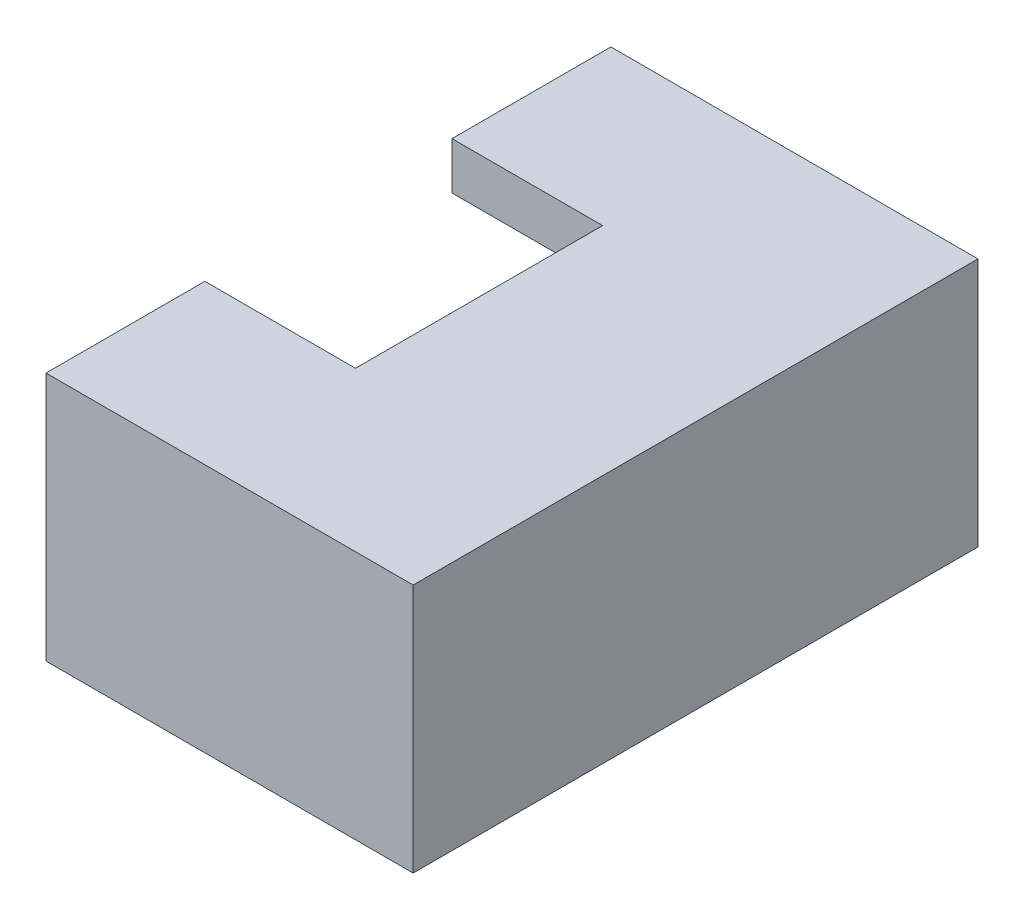
ISO-10303-21;
HEADER;
FILE_DESCRIPTION(('STEP AP214'),'2;1');
FILE_NAME('part.step','',(''),(''),'','','');
FILE_SCHEMA(('AUTOMOTIVE_DESIGN { 1 0 10303 214 1 1 1 1 }'));
ENDSEC;
DATA;
#1=APPLICATION_CONTEXT('core data for automotive mechanical design processes');
#2=APPLICATION_PROTOCOL_DEFINITION('international standard','automotive_design',2000,#1);
#3=PRODUCT_CONTEXT('',#1,'mechanical');
#4=PRODUCT('Part','Part','',(#3));
#5=PRODUCT_RELATED_PRODUCT_CATEGORY('part','',(#4));
#6=PRODUCT_DEFINITION_FORMATION('','',#4);
#7=PRODUCT_DEFINITION_CONTEXT('part definition',#1,'design');
#8=PRODUCT_DEFINITION('design','',#6,#7);
#9=PRODUCT_DEFINITION_SHAPE('','',#8);
#10=(LENGTH_UNIT() NAMED_UNIT(*) SI_UNIT(.MILLI.,.METRE.));
#11=(NAMED_UNIT(*) PLANE_ANGLE_UNIT() SI_UNIT($,.RADIAN.));
#12=(NAMED_UNIT(*) SI_UNIT($,.STERADIAN.) SOLID_ANGLE_UNIT());
#13=UNCERTAINTY_MEASURE_WITH_UNIT(LENGTH_MEASURE(1.E-05),#10,'distance_accuracy_value','');
#14=(GEOMETRIC_REPRESENTATION_CONTEXT(3) GLOBAL_UNCERTAINTY_ASSIGNED_CONTEXT((#13)) GLOBAL_UNIT_ASSIGNED_CONTEXT((#10,
#11,#12)) REPRESENTATION_CONTEXT('',''));
#15=CARTESIAN_POINT('',(0.,0.,0.));
#16=DIRECTION('',(0.,0.,1.));
#17=DIRECTION('',(1.,0.,0.));
#18=AXIS2_PLACEMENT_3D('',#15,#16,#17);
#19=CARTESIAN_POINT('',(3.55,3.4,-1.3));
#20=DIRECTION('',(0.,-1.,0.));
#21=DIRECTION('',(0.,0.,-1.));
#22=AXIS2_PLACEMENT_3D('',#19,#20,#21);
#23=PLANE('',#22);
#24=DIRECTION('',(1.,0.,0.));
#25=VECTOR('',#24,1.);
#26=CARTESIAN_POINT('',(3.55,3.4,-1.3));
#27=LINE('',#26,#25);
#28=CARTESIAN_POINT('',(7.55,3.4,-1.3));
#29=VERTEX_POINT('',#28);
#30=CARTESIAN_POINT('',(3.55,3.4,-1.3));
#31=VERTEX_POINT('',#30);
#32=EDGE_CURVE('P0_E64',#29,#31,#27,.F.);
#33=ORIENTED_EDGE('',*,*,#32,.T.);
#34=DIRECTION('',(0.,0.,1.));
#35=VECTOR('',#34,1.);
#36=CARTESIAN_POINT('',(3.55000000000001,3.4,0.));
#37=LINE('',#36,#35);
#38=CARTESIAN_POINT('',(3.55,3.4,-0.999999999999999));
#39=VERTEX_POINT('',#38);
#40=EDGE_CURVE('P0_E54',#39,#31,#37,.F.);
#41=ORIENTED_EDGE('',*,*,#40,.F.);
#42=DIRECTION('',(-1.,0.,0.));
#43=VECTOR('',#42,1.);
#44=CARTESIAN_POINT('',(3.55,3.4,-0.999999999999999));
#45=LINE('',#44,#43);
#46=CARTESIAN_POINT('',(7.55,3.4,-1.));
#47=VERTEX_POINT('',#46);
#48=EDGE_CURVE('P0_E74',#39,#47,#45,.F.);
#49=ORIENTED_EDGE('',*,*,#48,.T.);
#50=DIRECTION('',(0.,0.,-1.));
#51=VECTOR('',#50,1.);
#52=CARTESIAN_POINT('',(7.55,3.4,-1.3));
#53=LINE('',#52,#51);
#54=EDGE_CURVE('P0_E19',#29,#47,#53,.F.);
#55=ORIENTED_EDGE('',*,*,#54,.F.);
#56=EDGE_LOOP('',(#33,#41,#49,#55));
#57=FACE_BOUND('',#56,.T.);
#58=ADVANCED_FACE('P0_F16',(#57),#23,.F.);
#59=CARTESIAN_POINT('',(3.55,3.4,-1.3));
#60=DIRECTION('',(0.,0.,1.));
#61=DIRECTION('',(1.,0.,0.));
#62=AXIS2_PLACEMENT_3D('',#59,#60,#61);
#63=PLANE('',#62);
#64=DIRECTION('',(1.,0.,0.));
#65=VECTOR('',#64,1.);
#66=CARTESIAN_POINT('',(3.55,3.1,-1.3));
#67=LINE('',#66,#65);
#68=CARTESIAN_POINT('',(7.55,3.1,-1.3));
#69=VERTEX_POINT('',#68);
#70=CARTESIAN_POINT('',(3.55,3.1,-1.3));
#71=VERTEX_POINT('',#70);
#72=EDGE_CURVE('P0_E72',#69,#71,#67,.F.);
#73=ORIENTED_EDGE('',*,*,#72,.T.);
#74=DIRECTION('',(0.,1.,0.));
#75=VECTOR('',#74,1.);
#76=CARTESIAN_POINT('',(3.55,0.,-1.3));
#77=LINE('',#76,#75);
#78=EDGE_CURVE('P0_E61',#31,#71,#77,.F.);
#79=ORIENTED_EDGE('',*,*,#78,.F.);
#80=ORIENTED_EDGE('',*,*,#32,.F.);
#81=DIRECTION('',(0.,1.,0.));
#82=VECTOR('',#81,1.);
#83=CARTESIAN_POINT('',(7.55,0.,-1.3));
#84=LINE('',#83,#82);
#85=EDGE_CURVE('P0_E78',#29,#69,#84,.F.);
#86=ORIENTED_EDGE('',*,*,#85,.T.);
#87=EDGE_LOOP('',(#73,#79,#80,#86));
#88=FACE_BOUND('',#87,.T.);
#89=ADVANCED_FACE('P0_F71',(#88),#63,.F.);
#90=CARTESIAN_POINT('',(3.55000000000001,0.,0.));
#91=DIRECTION('',(-1.,0.,0.));
#92=DIRECTION('',(0.,0.,1.));
#93=AXIS2_PLACEMENT_3D('',#90,#91,#92);
#94=PLANE('',#93);
#95=ORIENTED_EDGE('',*,*,#78,.T.);
#96=DIRECTION('',(0.,0.,1.));
#97=VECTOR('',#96,1.);
#98=CARTESIAN_POINT('',(3.55,3.1,-1.3));
#99=LINE('',#98,#97);
#100=CARTESIAN_POINT('',(3.55,3.1,-0.999999999999999));
#101=VERTEX_POINT('',#100);
#102=EDGE_CURVE('P0_E82',#71,#101,#99,.T.);
#103=ORIENTED_EDGE('',*,*,#102,.T.);
#104=DIRECTION('',(0.,1.,0.));
#105=VECTOR('',#104,1.);
#106=CARTESIAN_POINT('',(3.55,3.4,-0.999999999999999));
#107=LINE('',#106,#105);
#108=EDGE_CURVE('P0_E63',#101,#39,#107,.T.);
#109=ORIENTED_EDGE('',*,*,#108,.T.);
#110=ORIENTED_EDGE('',*,*,#40,.T.);
#111=EDGE_LOOP('',(#95,#103,#109,#110));
#112=FACE_BOUND('',#111,.T.);
#113=ADVANCED_FACE('P0_F58',(#112),#94,.T.);
#114=CARTESIAN_POINT('',(3.55,3.4,-0.999999999999999));
#115=DIRECTION('',(0.,0.,-1.));
#116=DIRECTION('',(-1.,0.,0.));
#117=AXIS2_PLACEMENT_3D('',#114,#115,#116);
#118=PLANE('',#117);
#119=ORIENTED_EDGE('',*,*,#48,.F.);
#120=ORIENTED_EDGE('',*,*,#108,.F.);
#121=DIRECTION('',(1.,0.,0.));
#122=VECTOR('',#121,1.);
#123=CARTESIAN_POINT('',(3.55,3.1,-0.999999999999999));
#124=LINE('',#123,#122);
#125=CARTESIAN_POINT('',(7.55,3.1,-1.));
#126=VERTEX_POINT('',#125);
#127=EDGE_CURVE('P0_E25',#101,#126,#124,.T.);
#128=ORIENTED_EDGE('',*,*,#127,.T.);
#129=DIRECTION('',(0.,1.,0.));
#130=VECTOR('',#129,1.);
#131=CARTESIAN_POINT('',(7.55,0.,-1.));
#132=LINE('',#131,#130);
#133=EDGE_CURVE('P0_E33',#126,#47,#132,.T.);
#134=ORIENTED_EDGE('',*,*,#133,.T.);
#135=EDGE_LOOP('',(#119,#120,#128,#134));
#136=FACE_BOUND('',#135,.T.);
#137=ADVANCED_FACE('P0_F87',(#136),#118,.F.);
#138=CARTESIAN_POINT('',(7.55000000000001,0.,0.));
#139=DIRECTION('',(-1.,0.,0.));
#140=DIRECTION('',(0.,0.,1.));
#141=AXIS2_PLACEMENT_3D('',#138,#139,#140);
#142=PLANE('',#141);
#143=DIRECTION('',(0.,0.,1.));
#144=VECTOR('',#143,1.);
#145=CARTESIAN_POINT('',(7.55,3.1,-1.3));
#146=LINE('',#145,#144);
#147=EDGE_CURVE('P0_E11',#126,#69,#146,.F.);
#148=ORIENTED_EDGE('',*,*,#147,.T.);
#149=ORIENTED_EDGE('',*,*,#85,.F.);
#150=ORIENTED_EDGE('',*,*,#54,.T.);
#151=ORIENTED_EDGE('',*,*,#133,.F.);
#152=EDGE_LOOP('',(#148,#149,#150,#151));
#153=FACE_BOUND('',#152,.T.);
#154=ADVANCED_FACE('P0_F90',(#153),#142,.F.);
#155=CARTESIAN_POINT('',(3.55,3.1,-1.3));
#156=DIRECTION('',(0.,1.,0.));
#157=DIRECTION('',(0.,0.,1.));
#158=AXIS2_PLACEMENT_3D('',#155,#156,#157);
#159=PLANE('',#158);
#160=ORIENTED_EDGE('',*,*,#127,.F.);
#161=ORIENTED_EDGE('',*,*,#102,.F.);
#162=ORIENTED_EDGE('',*,*,#72,.F.);
#163=ORIENTED_EDGE('',*,*,#147,.F.);
#164=EDGE_LOOP('',(#160,#161,#162,#163));
#165=FACE_BOUND('',#164,.T.);
#166=ADVANCED_FACE('P0_F89',(#165),#159,.F.);
#167=CLOSED_SHELL('',(#58,#89,#113,#137,#154,#166));
#168=MANIFOLD_SOLID_BREP('P0_B1',#167);
#169=CARTESIAN_POINT('',(3.55,3.4,1.));
#170=DIRECTION('',(0.,-1.,0.));
#171=DIRECTION('',(0.,0.,-1.));
#172=AXIS2_PLACEMENT_3D('',#169,#170,#171);
#173=PLANE('',#172);
#174=DIRECTION('',(1.,0.,0.));
#175=VECTOR('',#174,1.);
#176=CARTESIAN_POINT('',(3.55,3.4,1.));
#177=LINE('',#176,#175);
#178=CARTESIAN_POINT('',(7.55,3.4,1.));
#179=VERTEX_POINT('',#178);
#180=CARTESIAN_POINT('',(3.55,3.4,1.));
#181=VERTEX_POINT('',#180);
#182=EDGE_CURVE('P1_E64',#179,#181,#177,.F.);
#183=ORIENTED_EDGE('',*,*,#182,.T.);
#184=DIRECTION('',(0.,0.,1.));
#185=VECTOR('',#184,1.);
#186=CARTESIAN_POINT('',(3.55,3.4,0.));
#187=LINE('',#186,#185);
#188=CARTESIAN_POINT('',(3.55,3.4,1.3));
#189=VERTEX_POINT('',#188);
#190=EDGE_CURVE('P1_E54',#189,#181,#187,.F.);
#191=ORIENTED_EDGE('',*,*,#190,.F.);
#192=DIRECTION('',(-1.,0.,0.));
#193=VECTOR('',#192,1.);
#194=CARTESIAN_POINT('',(3.55,3.4,1.3));
#195=LINE('',#194,#193);
#196=CARTESIAN_POINT('',(7.55,3.4,1.3));
#197=VERTEX_POINT('',#196);
#198=EDGE_CURVE('P1_E74',#189,#197,#195,.F.);
#199=ORIENTED_EDGE('',*,*,#198,.T.);
#200=DIRECTION('',(0.,0.,-1.));
#201=VECTOR('',#200,1.);
#202=CARTESIAN_POINT('',(7.55,3.4,1.));
#203=LINE('',#202,#201);
#204=EDGE_CURVE('P1_E19',#179,#197,#203,.F.);
#205=ORIENTED_EDGE('',*,*,#204,.F.);
#206=EDGE_LOOP('',(#183,#191,#199,#205));
#207=FACE_BOUND('',#206,.T.);
#208=ADVANCED_FACE('P1_F16',(#207),#173,.F.);
#209=CARTESIAN_POINT('',(3.55,3.4,1.));
#210=DIRECTION('',(0.,0.,1.));
#211=DIRECTION('',(1.,0.,0.));
#212=AXIS2_PLACEMENT_3D('',#209,#210,#211);
#213=PLANE('',#212);
#214=DIRECTION('',(1.,0.,0.));
#215=VECTOR('',#214,1.);
#216=CARTESIAN_POINT('',(3.55,3.1,0.999999999999999));
#217=LINE('',#216,#215);
#218=CARTESIAN_POINT('',(7.55,3.1,0.999999999999999));
#219=VERTEX_POINT('',#218);
#220=CARTESIAN_POINT('',(3.55,3.1,1.));
#221=VERTEX_POINT('',#220);
#222=EDGE_CURVE('P1_E72',#219,#221,#217,.F.);
#223=ORIENTED_EDGE('',*,*,#222,.T.);
#224=DIRECTION('',(0.,1.,0.));
#225=VECTOR('',#224,1.);
#226=CARTESIAN_POINT('',(3.55,0.,1.));
#227=LINE('',#226,#225);
#228=EDGE_CURVE('P1_E61',#181,#221,#227,.F.);
#229=ORIENTED_EDGE('',*,*,#228,.F.);
#230=ORIENTED_EDGE('',*,*,#182,.F.);
#231=DIRECTION('',(0.,1.,0.));
#232=VECTOR('',#231,1.);
#233=CARTESIAN_POINT('',(7.55,0.,0.999999999999999));
#234=LINE('',#233,#232);
#235=EDGE_CURVE('P1_E78',#179,#219,#234,.F.);
#236=ORIENTED_EDGE('',*,*,#235,.T.);
#237=EDGE_LOOP('',(#223,#229,#230,#236));
#238=FACE_BOUND('',#237,.T.);
#239=ADVANCED_FACE('P1_F71',(#238),#213,.F.);
#240=CARTESIAN_POINT('',(3.55,0.,0.));
#241=DIRECTION('',(-1.,0.,0.));
#242=DIRECTION('',(0.,0.,1.));
#243=AXIS2_PLACEMENT_3D('',#240,#241,#242);
#244=PLANE('',#243);
#245=ORIENTED_EDGE('',*,*,#228,.T.);
#246=DIRECTION('',(0.,0.,1.));
#247=VECTOR('',#246,1.);
#248=CARTESIAN_POINT('',(3.55,3.1,1.));
#249=LINE('',#248,#247);
#250=CARTESIAN_POINT('',(3.55,3.1,1.3));
#251=VERTEX_POINT('',#250);
#252=EDGE_CURVE('P1_E82',#221,#251,#249,.T.);
#253=ORIENTED_EDGE('',*,*,#252,.T.);
#254=DIRECTION('',(0.,1.,0.));
#255=VECTOR('',#254,1.);
#256=CARTESIAN_POINT('',(3.55,3.4,1.3));
#257=LINE('',#256,#255);
#258=EDGE_CURVE('P1_E63',#251,#189,#257,.T.);
#259=ORIENTED_EDGE('',*,*,#258,.T.);
#260=ORIENTED_EDGE('',*,*,#190,.T.);
#261=EDGE_LOOP('',(#245,#253,#259,#260));
#262=FACE_BOUND('',#261,.T.);
#263=ADVANCED_FACE('P1_F58',(#262),#244,.T.);
#264=CARTESIAN_POINT('',(3.55,3.4,1.3));
#265=DIRECTION('',(0.,0.,-1.));
#266=DIRECTION('',(-1.,0.,0.));
#267=AXIS2_PLACEMENT_3D('',#264,#265,#266);
#268=PLANE('',#267);
#269=ORIENTED_EDGE('',*,*,#198,.F.);
#270=ORIENTED_EDGE('',*,*,#258,.F.);
#271=DIRECTION('',(1.,0.,0.));
#272=VECTOR('',#271,1.);
#273=CARTESIAN_POINT('',(3.55,3.1,1.3));
#274=LINE('',#273,#272);
#275=CARTESIAN_POINT('',(7.55,3.1,1.3));
#276=VERTEX_POINT('',#275);
#277=EDGE_CURVE('P1_E25',#251,#276,#274,.T.);
#278=ORIENTED_EDGE('',*,*,#277,.T.);
#279=DIRECTION('',(0.,1.,0.));
#280=VECTOR('',#279,1.);
#281=CARTESIAN_POINT('',(7.55,0.,1.3));
#282=LINE('',#281,#280);
#283=EDGE_CURVE('P1_E33',#276,#197,#282,.T.);
#284=ORIENTED_EDGE('',*,*,#283,.T.);
#285=EDGE_LOOP('',(#269,#270,#278,#284));
#286=FACE_BOUND('',#285,.T.);
#287=ADVANCED_FACE('P1_F87',(#286),#268,.F.);
#288=CARTESIAN_POINT('',(7.55,0.,0.));
#289=DIRECTION('',(-1.,0.,0.));
#290=DIRECTION('',(0.,0.,1.));
#291=AXIS2_PLACEMENT_3D('',#288,#289,#290);
#292=PLANE('',#291);
#293=DIRECTION('',(0.,0.,1.));
#294=VECTOR('',#293,1.);
#295=CARTESIAN_POINT('',(7.55,3.1,1.));
#296=LINE('',#295,#294);
#297=EDGE_CURVE('P1_E11',#276,#219,#296,.F.);
#298=ORIENTED_EDGE('',*,*,#297,.T.);
#299=ORIENTED_EDGE('',*,*,#235,.F.);
#300=ORIENTED_EDGE('',*,*,#204,.T.);
#301=ORIENTED_EDGE('',*,*,#283,.F.);
#302=EDGE_LOOP('',(#298,#299,#300,#301));
#303=FACE_BOUND('',#302,.T.);
#304=ADVANCED_FACE('P1_F90',(#303),#292,.F.);
#305=CARTESIAN_POINT('',(3.55,3.1,1.));
#306=DIRECTION('',(0.,1.,0.));
#307=DIRECTION('',(0.,0.,1.));
#308=AXIS2_PLACEMENT_3D('',#305,#306,#307);
#309=PLANE('',#308);
#310=ORIENTED_EDGE('',*,*,#277,.F.);
#311=ORIENTED_EDGE('',*,*,#252,.F.);
#312=ORIENTED_EDGE('',*,*,#222,.F.);
#313=ORIENTED_EDGE('',*,*,#297,.F.);
#314=EDGE_LOOP('',(#310,#311,#312,#313));
#315=FACE_BOUND('',#314,.T.);
#316=ADVANCED_FACE('P1_F89',(#315),#309,.F.);
#317=CLOSED_SHELL('',(#208,#239,#263,#287,#304,#316));
#318=MANIFOLD_SOLID_BREP('P1_B1',#317);
#319=CARTESIAN_POINT('',(7.55,5.55,-5.5));
#320=DIRECTION('',(0.,1.,0.));
#321=DIRECTION('',(0.,0.,1.));
#322=AXIS2_PLACEMENT_3D('',#319,#320,#321);
#323=PLANE('',#322);
#324=DIRECTION('',(-1.,0.,0.));
#325=VECTOR('',#324,1.);
#326=CARTESIAN_POINT('',(7.55,5.55,-5.5));
#327=LINE('',#326,#325);
#328=CARTESIAN_POINT('',(1.45,5.55,-5.5));
#329=VERTEX_POINT('',#328);
#330=CARTESIAN_POINT('',(7.55,5.55,-5.5));
#331=VERTEX_POINT('',#330);
#332=EDGE_CURVE('P2_E175',#329,#331,#327,.F.);
#333=ORIENTED_EDGE('',*,*,#332,.T.);
#334=DIRECTION('',(0.,0.,-1.));
#335=VECTOR('',#334,1.);
#336=CARTESIAN_POINT('',(7.55,5.55,0.));
#337=LINE('',#336,#335);
#338=CARTESIAN_POINT('',(7.55,5.55,-5.));
#339=VERTEX_POINT('',#338);
#340=EDGE_CURVE('P2_E150',#331,#339,#337,.F.);
#341=ORIENTED_EDGE('',*,*,#340,.T.);
#342=DIRECTION('',(1.,0.,0.));
#343=VECTOR('',#342,1.);
#344=CARTESIAN_POINT('',(7.55,5.55,-5.));
#345=LINE('',#344,#343);
#346=CARTESIAN_POINT('',(1.45,5.55,-5.));
#347=VERTEX_POINT('',#346);
#348=EDGE_CURVE('P2_E160',#339,#347,#345,.F.);
#349=ORIENTED_EDGE('',*,*,#348,.T.);
#350=DIRECTION('',(0.,0.,1.));
#351=VECTOR('',#350,1.);
#352=CARTESIAN_POINT('',(1.45,5.55,-5.5));
#353=LINE('',#352,#351);
#354=EDGE_CURVE('P2_E19',#329,#347,#353,.T.);
#355=ORIENTED_EDGE('',*,*,#354,.F.);
#356=EDGE_LOOP('',(#333,#341,#349,#355));
#357=FACE_BOUND('',#356,.T.);
#358=ADVANCED_FACE('P2_F16',(#357),#323,.F.);
#359=CARTESIAN_POINT('',(7.55,5.55,5.5));
#360=DIRECTION('',(0.,1.,0.));
#361=DIRECTION('',(0.,0.,1.));
#362=AXIS2_PLACEMENT_3D('',#359,#360,#361);
#363=PLANE('',#362);
#364=DIRECTION('',(-1.,0.,0.));
#365=VECTOR('',#364,1.);
#366=CARTESIAN_POINT('',(7.55,5.55,5.));
#367=LINE('',#366,#365);
#368=CARTESIAN_POINT('',(1.45,5.55,5.));
#369=VERTEX_POINT('',#368);
#370=CARTESIAN_POINT('',(7.55,5.55,5.));
#371=VERTEX_POINT('',#370);
#372=EDGE_CURVE('P2_E126',#369,#371,#367,.F.);
#373=ORIENTED_EDGE('',*,*,#372,.T.);
#374=DIRECTION('',(0.,0.,-1.));
#375=VECTOR('',#374,1.);
#376=CARTESIAN_POINT('',(7.55,5.55,0.));
#377=LINE('',#376,#375);
#378=CARTESIAN_POINT('',(7.55,5.55,5.5));
#379=VERTEX_POINT('',#378);
#380=EDGE_CURVE('P2_E155',#371,#379,#377,.F.);
#381=ORIENTED_EDGE('',*,*,#380,.T.);
#382=DIRECTION('',(1.,0.,0.));
#383=VECTOR('',#382,1.);
#384=CARTESIAN_POINT('',(7.55,5.55,5.5));
#385=LINE('',#384,#383);
#386=CARTESIAN_POINT('',(1.45,5.55,5.5));
#387=VERTEX_POINT('',#386);
#388=EDGE_CURVE('P2_E132',#379,#387,#385,.F.);
#389=ORIENTED_EDGE('',*,*,#388,.T.);
#390=DIRECTION('',(0.,0.,1.));
#391=VECTOR('',#390,1.);
#392=CARTESIAN_POINT('',(1.45,5.55,5.5));
#393=LINE('',#392,#391);
#394=EDGE_CURVE('P2_E129',#369,#387,#393,.T.);
#395=ORIENTED_EDGE('',*,*,#394,.F.);
#396=EDGE_LOOP('',(#373,#381,#389,#395));
#397=FACE_BOUND('',#396,.T.);
#398=ADVANCED_FACE('P2_F130',(#397),#363,.F.);
#399=CARTESIAN_POINT('',(7.55,5.55,5.));
#400=DIRECTION('',(0.,0.,-1.));
#401=DIRECTION('',(-1.,0.,0.));
#402=AXIS2_PLACEMENT_3D('',#399,#400,#401);
#403=PLANE('',#402);
#404=DIRECTION('',(1.,0.,0.));
#405=VECTOR('',#404,1.);
#406=CARTESIAN_POINT('',(7.55,5.05,5.));
#407=LINE('',#406,#405);
#408=CARTESIAN_POINT('',(1.45,5.05,5.));
#409=VERTEX_POINT('',#408);
#410=CARTESIAN_POINT('',(7.55,5.05,5.));
#411=VERTEX_POINT('',#410);
#412=EDGE_CURVE('P2_E201',#409,#411,#407,.T.);
#413=ORIENTED_EDGE('',*,*,#412,.T.);
#414=DIRECTION('',(0.,1.,0.));
#415=VECTOR('',#414,1.);
#416=CARTESIAN_POINT('',(7.55,0.,5.));
#417=LINE('',#416,#415);
#418=EDGE_CURVE('P2_E143',#411,#371,#417,.T.);
#419=ORIENTED_EDGE('',*,*,#418,.T.);
#420=ORIENTED_EDGE('',*,*,#372,.F.);
#421=DIRECTION('',(0.,1.,0.));
#422=VECTOR('',#421,1.);
#423=CARTESIAN_POINT('',(1.45,5.55,5.));
#424=LINE('',#423,#422);
#425=EDGE_CURVE('P2_E141',#409,#369,#424,.T.);
#426=ORIENTED_EDGE('',*,*,#425,.F.);
#427=EDGE_LOOP('',(#413,#419,#420,#426));
#428=FACE_BOUND('',#427,.T.);
#429=ADVANCED_FACE('P2_F140',(#428),#403,.F.);
#430=CARTESIAN_POINT('',(7.55,0.,0.));
#431=DIRECTION('',(1.,0.,0.));
#432=DIRECTION('',(0.,0.,-1.));
#433=AXIS2_PLACEMENT_3D('',#430,#431,#432);
#434=PLANE('',#433);
#435=DIRECTION('',(0.,0.,-1.));
#436=VECTOR('',#435,1.);
#437=CARTESIAN_POINT('',(7.55,1.25,-5.5));
#438=LINE('',#437,#436);
#439=CARTESIAN_POINT('',(7.55,1.25,-5.5));
#440=VERTEX_POINT('',#439);
#441=CARTESIAN_POINT('',(7.55,1.25,5.5));
#442=VERTEX_POINT('',#441);
#443=EDGE_CURVE('P2_E183',#440,#442,#438,.F.);
#444=ORIENTED_EDGE('',*,*,#443,.T.);
#445=DIRECTION('',(0.,1.,0.));
#446=VECTOR('',#445,1.);
#447=CARTESIAN_POINT('',(7.55,5.05,5.5));
#448=LINE('',#447,#446);
#449=EDGE_CURVE('P2_E188',#442,#379,#448,.T.);
#450=ORIENTED_EDGE('',*,*,#449,.T.);
#451=ORIENTED_EDGE('',*,*,#380,.F.);
#452=ORIENTED_EDGE('',*,*,#418,.F.);
#453=DIRECTION('',(0.,0.,1.));
#454=VECTOR('',#453,1.);
#455=CARTESIAN_POINT('',(7.55,5.05,-5.));
#456=LINE('',#455,#454);
#457=CARTESIAN_POINT('',(7.55,5.05,-5.));
#458=VERTEX_POINT('',#457);
#459=EDGE_CURVE('P2_E203',#411,#458,#456,.F.);
#460=ORIENTED_EDGE('',*,*,#459,.T.);
#461=DIRECTION('',(0.,1.,0.));
#462=VECTOR('',#461,1.);
#463=CARTESIAN_POINT('',(7.55,5.55,-5.));
#464=LINE('',#463,#462);
#465=EDGE_CURVE('P2_E157',#458,#339,#464,.T.);
#466=ORIENTED_EDGE('',*,*,#465,.T.);
#467=ORIENTED_EDGE('',*,*,#340,.F.);
#468=DIRECTION('',(0.,1.,0.));
#469=VECTOR('',#468,1.);
#470=CARTESIAN_POINT('',(7.55,5.05,-5.5));
#471=LINE('',#470,#469);
#472=EDGE_CURVE('P2_E178',#331,#440,#471,.F.);
#473=ORIENTED_EDGE('',*,*,#472,.T.);
#474=EDGE_LOOP('',(#444,#450,#451,#452,#460,#466,#467,#473));
#475=FACE_BOUND('',#474,.T.);
#476=ADVANCED_FACE('P2_F319',(#475),#434,.F.);
#477=CARTESIAN_POINT('',(7.55,5.55,-5.));
#478=DIRECTION('',(0.,0.,1.));
#479=DIRECTION('',(1.,0.,0.));
#480=AXIS2_PLACEMENT_3D('',#477,#478,#479);
#481=PLANE('',#480);
#482=ORIENTED_EDGE('',*,*,#348,.F.);
#483=ORIENTED_EDGE('',*,*,#465,.F.);
#484=DIRECTION('',(1.,0.,0.));
#485=VECTOR('',#484,1.);
#486=CARTESIAN_POINT('',(7.55,5.05,-5.));
#487=LINE('',#486,#485);
#488=CARTESIAN_POINT('',(1.45,5.05,-5.));
#489=VERTEX_POINT('',#488);
#490=EDGE_CURVE('P2_E206',#458,#489,#487,.F.);
#491=ORIENTED_EDGE('',*,*,#490,.T.);
#492=DIRECTION('',(0.,1.,0.));
#493=VECTOR('',#492,1.);
#494=CARTESIAN_POINT('',(1.45,5.55,-5.));
#495=LINE('',#494,#493);
#496=EDGE_CURVE('P2_E163',#347,#489,#495,.F.);
#497=ORIENTED_EDGE('',*,*,#496,.F.);
#498=EDGE_LOOP('',(#482,#483,#491,#497));
#499=FACE_BOUND('',#498,.T.);
#500=ADVANCED_FACE('P2_F315',(#499),#481,.F.);
#501=CARTESIAN_POINT('',(1.45,1.75,-2.625));
#502=DIRECTION('',(0.,0.,-1.));
#503=DIRECTION('',(-1.,0.,0.));
#504=AXIS2_PLACEMENT_3D('',#501,#502,#503);
#505=PLANE('',#504);
#506=DIRECTION('',(1.,0.,0.));
#507=VECTOR('',#506,1.);
#508=CARTESIAN_POINT('',(7.55,5.05,-2.625));
#509=LINE('',#508,#507);
#510=CARTESIAN_POINT('',(1.45,5.05,-2.625));
#511=VERTEX_POINT('',#510);
#512=CARTESIAN_POINT('',(4.65,5.05,-2.625));
#513=VERTEX_POINT('',#512);
#514=EDGE_CURVE('P2_E192',#511,#513,#509,.T.);
#515=ORIENTED_EDGE('',*,*,#514,.T.);
#516=DIRECTION('',(0.,1.,0.));
#517=VECTOR('',#516,1.);
#518=CARTESIAN_POINT('',(4.65,1.75,-2.625));
#519=LINE('',#518,#517);
#520=CARTESIAN_POINT('',(4.65,6.05,-2.625));
#521=VERTEX_POINT('',#520);
#522=EDGE_CURVE('P2_E167',#513,#521,#519,.T.);
#523=ORIENTED_EDGE('',*,*,#522,.T.);
#524=DIRECTION('',(1.,0.,0.));
#525=VECTOR('',#524,1.);
#526=CARTESIAN_POINT('',(0.,6.05,-2.625));
#527=LINE('',#526,#525);
#528=CARTESIAN_POINT('',(1.45,6.05,-2.625));
#529=VERTEX_POINT('',#528);
#530=EDGE_CURVE('P2_E209',#529,#521,#527,.T.);
#531=ORIENTED_EDGE('',*,*,#530,.F.);
#532=DIRECTION('',(0.,1.,0.));
#533=VECTOR('',#532,1.);
#534=CARTESIAN_POINT('',(1.45,1.75,-2.625));
#535=LINE('',#534,#533);
#536=EDGE_CURVE('P2_E165',#511,#529,#535,.T.);
#537=ORIENTED_EDGE('',*,*,#536,.F.);
#538=EDGE_LOOP('',(#515,#523,#531,#537));
#539=FACE_BOUND('',#538,.T.);
#540=ADVANCED_FACE('P2_F311',(#539),#505,.F.);
#541=CARTESIAN_POINT('',(4.65,1.75,-2.625));
#542=DIRECTION('',(1.,0.,0.));
#543=DIRECTION('',(0.,0.,-1.));
#544=AXIS2_PLACEMENT_3D('',#541,#542,#543);
#545=PLANE('',#544);
#546=DIRECTION('',(0.,0.,1.));
#547=VECTOR('',#546,1.);
#548=CARTESIAN_POINT('',(4.65,5.05,-5.));
#549=LINE('',#548,#547);
#550=CARTESIAN_POINT('',(4.65,5.05,2.625));
#551=VERTEX_POINT('',#550);
#552=EDGE_CURVE('P2_E195',#513,#551,#549,.T.);
#553=ORIENTED_EDGE('',*,*,#552,.T.);
#554=DIRECTION('',(0.,1.,0.));
#555=VECTOR('',#554,1.);
#556=CARTESIAN_POINT('',(4.65,1.75,2.625));
#557=LINE('',#556,#555);
#558=CARTESIAN_POINT('',(4.65,6.05,2.625));
#559=VERTEX_POINT('',#558);
#560=EDGE_CURVE('P2_E172',#551,#559,#557,.T.);
#561=ORIENTED_EDGE('',*,*,#560,.T.);
#562=DIRECTION('',(0.,0.,1.));
#563=VECTOR('',#562,1.);
#564=CARTESIAN_POINT('',(4.65,6.05,0.));
#565=LINE('',#564,#563);
#566=EDGE_CURVE('P2_E211',#521,#559,#565,.T.);
#567=ORIENTED_EDGE('',*,*,#566,.F.);
#568=ORIENTED_EDGE('',*,*,#522,.F.);
#569=EDGE_LOOP('',(#553,#561,#567,#568));
#570=FACE_BOUND('',#569,.T.);
#571=ADVANCED_FACE('P2_F307',(#570),#545,.F.);
#572=CARTESIAN_POINT('',(1.45,1.75,2.625));
#573=DIRECTION('',(0.,0.,1.));
#574=DIRECTION('',(1.,0.,0.));
#575=AXIS2_PLACEMENT_3D('',#572,#573,#574);
#576=PLANE('',#575);
#577=DIRECTION('',(1.,0.,0.));
#578=VECTOR('',#577,1.);
#579=CARTESIAN_POINT('',(7.55,5.05,2.625));
#580=LINE('',#579,#578);
#581=CARTESIAN_POINT('',(1.45,5.05,2.625));
#582=VERTEX_POINT('',#581);
#583=EDGE_CURVE('P2_E198',#551,#582,#580,.F.);
#584=ORIENTED_EDGE('',*,*,#583,.T.);
#585=DIRECTION('',(0.,1.,0.));
#586=VECTOR('',#585,1.);
#587=CARTESIAN_POINT('',(1.45,1.75,2.625));
#588=LINE('',#587,#586);
#589=CARTESIAN_POINT('',(1.45,6.05,2.625));
#590=VERTEX_POINT('',#589);
#591=EDGE_CURVE('P2_E170',#590,#582,#588,.F.);
#592=ORIENTED_EDGE('',*,*,#591,.F.);
#593=DIRECTION('',(1.,0.,0.));
#594=VECTOR('',#593,1.);
#595=CARTESIAN_POINT('',(0.,6.05,2.625));
#596=LINE('',#595,#594);
#597=EDGE_CURVE('P2_E213',#559,#590,#596,.F.);
#598=ORIENTED_EDGE('',*,*,#597,.F.);
#599=ORIENTED_EDGE('',*,*,#560,.F.);
#600=EDGE_LOOP('',(#584,#592,#598,#599));
#601=FACE_BOUND('',#600,.T.);
#602=ADVANCED_FACE('P2_F303',(#601),#576,.F.);
#603=CARTESIAN_POINT('',(7.55,5.05,-5.5));
#604=DIRECTION('',(0.,0.,-1.));
#605=DIRECTION('',(-1.,0.,0.));
#606=AXIS2_PLACEMENT_3D('',#603,#604,#605);
#607=PLANE('',#606);
#608=DIRECTION('',(1.,0.,0.));
#609=VECTOR('',#608,1.);
#610=CARTESIAN_POINT('',(7.55,1.25,-5.5));
#611=LINE('',#610,#609);
#612=CARTESIAN_POINT('',(1.45,1.25,-5.5));
#613=VERTEX_POINT('',#612);
#614=EDGE_CURVE('P2_E180',#613,#440,#611,.T.);
#615=ORIENTED_EDGE('',*,*,#614,.T.);
#616=ORIENTED_EDGE('',*,*,#472,.F.);
#617=ORIENTED_EDGE('',*,*,#332,.F.);
#618=DIRECTION('',(0.,1.,0.));
#619=VECTOR('',#618,1.);
#620=CARTESIAN_POINT('',(1.45,6.05,-5.5));
#621=LINE('',#620,#619);
#622=EDGE_CURVE('P2_E218',#329,#613,#621,.F.);
#623=ORIENTED_EDGE('',*,*,#622,.T.);
#624=EDGE_LOOP('',(#615,#616,#617,#623));
#625=FACE_BOUND('',#624,.T.);
#626=ADVANCED_FACE('P2_F299',(#625),#607,.F.);
#627=CARTESIAN_POINT('',(7.55,1.25,-5.5));
#628=DIRECTION('',(0.,-1.,0.));
#629=DIRECTION('',(0.,0.,-1.));
#630=AXIS2_PLACEMENT_3D('',#627,#628,#629);
#631=PLANE('',#630);
#632=DIRECTION('',(1.,0.,0.));
#633=VECTOR('',#632,1.);
#634=CARTESIAN_POINT('',(7.55,1.25,5.5));
#635=LINE('',#634,#633);
#636=CARTESIAN_POINT('',(1.45,1.25,5.5));
#637=VERTEX_POINT('',#636);
#638=EDGE_CURVE('P2_E185',#637,#442,#635,.T.);
#639=ORIENTED_EDGE('',*,*,#638,.T.);
#640=ORIENTED_EDGE('',*,*,#443,.F.);
#641=ORIENTED_EDGE('',*,*,#614,.F.);
#642=DIRECTION('',(0.,0.,-1.));
#643=VECTOR('',#642,1.);
#644=CARTESIAN_POINT('',(1.45,1.25,-6.));
#645=LINE('',#644,#643);
#646=EDGE_CURVE('P2_E221',#613,#637,#645,.F.);
#647=ORIENTED_EDGE('',*,*,#646,.T.);
#648=EDGE_LOOP('',(#639,#640,#641,#647));
#649=FACE_BOUND('',#648,.T.);
#650=ADVANCED_FACE('P2_F295',(#649),#631,.F.);
#651=CARTESIAN_POINT('',(7.55,5.05,5.5));
#652=DIRECTION('',(0.,0.,1.));
#653=DIRECTION('',(1.,0.,0.));
#654=AXIS2_PLACEMENT_3D('',#651,#652,#653);
#655=PLANE('',#654);
#656=ORIENTED_EDGE('',*,*,#388,.F.);
#657=ORIENTED_EDGE('',*,*,#449,.F.);
#658=ORIENTED_EDGE('',*,*,#638,.F.);
#659=DIRECTION('',(0.,1.,0.));
#660=VECTOR('',#659,1.);
#661=CARTESIAN_POINT('',(1.45,6.05,5.5));
#662=LINE('',#661,#660);
#663=EDGE_CURVE('P2_E224',#637,#387,#662,.T.);
#664=ORIENTED_EDGE('',*,*,#663,.T.);
#665=EDGE_LOOP('',(#656,#657,#658,#664));
#666=FACE_BOUND('',#665,.T.);
#667=ADVANCED_FACE('P2_F291',(#666),#655,.F.);
#668=CARTESIAN_POINT('',(7.55,5.05,-5.));
#669=DIRECTION('',(0.,1.,0.));
#670=DIRECTION('',(0.,0.,1.));
#671=AXIS2_PLACEMENT_3D('',#668,#669,#670);
#672=PLANE('',#671);
#673=ORIENTED_EDGE('',*,*,#490,.F.);
#674=ORIENTED_EDGE('',*,*,#459,.F.);
#675=ORIENTED_EDGE('',*,*,#412,.F.);
#676=DIRECTION('',(0.,0.,-1.));
#677=VECTOR('',#676,1.);
#678=CARTESIAN_POINT('',(1.45,5.05,-6.));
#679=LINE('',#678,#677);
#680=EDGE_CURVE('P2_E149',#409,#582,#679,.T.);
#681=ORIENTED_EDGE('',*,*,#680,.T.);
#682=ORIENTED_EDGE('',*,*,#583,.F.);
#683=ORIENTED_EDGE('',*,*,#552,.F.);
#684=ORIENTED_EDGE('',*,*,#514,.F.);
#685=DIRECTION('',(0.,0.,-1.));
#686=VECTOR('',#685,1.);
#687=CARTESIAN_POINT('',(1.45,5.05,-6.));
#688=LINE('',#687,#686);
#689=EDGE_CURVE('P2_E235',#511,#489,#688,.T.);
#690=ORIENTED_EDGE('',*,*,#689,.T.);
#691=EDGE_LOOP('',(#673,#674,#675,#681,#682,#683,#684,#690));
#692=FACE_BOUND('',#691,.T.);
#693=ADVANCED_FACE('P2_F287',(#692),#672,.F.);
#694=CARTESIAN_POINT('',(0.,6.05,0.));
#695=DIRECTION('',(0.,1.,0.));
#696=DIRECTION('',(0.,0.,1.));
#697=AXIS2_PLACEMENT_3D('',#694,#695,#696);
#698=PLANE('',#697);
#699=DIRECTION('',(1.,0.,0.));
#700=VECTOR('',#699,1.);
#701=CARTESIAN_POINT('',(1.45,6.05,-6.));
#702=LINE('',#701,#700);
#703=CARTESIAN_POINT('',(9.25,6.05,-6.));
#704=VERTEX_POINT('',#703);
#705=CARTESIAN_POINT('',(1.45,6.05,-6.));
#706=VERTEX_POINT('',#705);
#707=EDGE_CURVE('P2_E216',#704,#706,#702,.F.);
#708=ORIENTED_EDGE('',*,*,#707,.T.);
#709=DIRECTION('',(0.,0.,-1.));
#710=VECTOR('',#709,1.);
#711=CARTESIAN_POINT('',(1.45,6.05,-6.));
#712=LINE('',#711,#710);
#713=EDGE_CURVE('P2_E232',#706,#529,#712,.F.);
#714=ORIENTED_EDGE('',*,*,#713,.T.);
#715=ORIENTED_EDGE('',*,*,#530,.T.);
#716=ORIENTED_EDGE('',*,*,#566,.T.);
#717=ORIENTED_EDGE('',*,*,#597,.T.);
#718=DIRECTION('',(0.,0.,-1.));
#719=VECTOR('',#718,1.);
#720=CARTESIAN_POINT('',(1.45,6.05,-6.));
#721=LINE('',#720,#719);
#722=CARTESIAN_POINT('',(1.45,6.05,6.));
#723=VERTEX_POINT('',#722);
#724=EDGE_CURVE('P2_E227',#590,#723,#721,.F.);
#725=ORIENTED_EDGE('',*,*,#724,.T.);
#726=DIRECTION('',(-1.,0.,0.));
#727=VECTOR('',#726,1.);
#728=CARTESIAN_POINT('',(1.45,6.05,6.));
#729=LINE('',#728,#727);
#730=CARTESIAN_POINT('',(9.25,6.05,6.));
#731=VERTEX_POINT('',#730);
#732=EDGE_CURVE('P2_E241',#723,#731,#729,.F.);
#733=ORIENTED_EDGE('',*,*,#732,.T.);
#734=DIRECTION('',(0.,0.,1.));
#735=VECTOR('',#734,1.);
#736=CARTESIAN_POINT('',(9.25,6.05,-6.));
#737=LINE('',#736,#735);
#738=EDGE_CURVE('P2_E244',#731,#704,#737,.F.);
#739=ORIENTED_EDGE('',*,*,#738,.T.);
#740=EDGE_LOOP('',(#708,#714,#715,#716,#717,#725,#733,#739));
#741=FACE_BOUND('',#740,.T.);
#742=ADVANCED_FACE('P2_F284',(#741),#698,.T.);
#743=CARTESIAN_POINT('',(1.45,6.05,-6.));
#744=DIRECTION('',(0.,0.,1.));
#745=DIRECTION('',(1.,0.,0.));
#746=AXIS2_PLACEMENT_3D('',#743,#744,#745);
#747=PLANE('',#746);
#748=DIRECTION('',(0.,1.,0.));
#749=VECTOR('',#748,1.);
#750=CARTESIAN_POINT('',(1.45,6.05,-6.));
#751=LINE('',#750,#749);
#752=CARTESIAN_POINT('',(1.45,0.75,-6.));
#753=VERTEX_POINT('',#752);
#754=EDGE_CURVE('P2_E229',#753,#706,#751,.T.);
#755=ORIENTED_EDGE('',*,*,#754,.T.);
#756=ORIENTED_EDGE('',*,*,#707,.F.);
#757=DIRECTION('',(0.,1.,0.));
#758=VECTOR('',#757,1.);
#759=CARTESIAN_POINT('',(9.25,6.05,-6.));
#760=LINE('',#759,#758);
#761=CARTESIAN_POINT('',(9.25,0.75,-6.));
#762=VERTEX_POINT('',#761);
#763=EDGE_CURVE('P2_E247',#704,#762,#760,.F.);
#764=ORIENTED_EDGE('',*,*,#763,.T.);
#765=DIRECTION('',(1.,0.,0.));
#766=VECTOR('',#765,1.);
#767=CARTESIAN_POINT('',(0.,0.75,-6.));
#768=LINE('',#767,#766);
#769=EDGE_CURVE('P2_E250',#762,#753,#768,.F.);
#770=ORIENTED_EDGE('',*,*,#769,.T.);
#771=EDGE_LOOP('',(#755,#756,#764,#770));
#772=FACE_BOUND('',#771,.T.);
#773=ADVANCED_FACE('P2_F267',(#772),#747,.F.);
#774=CARTESIAN_POINT('',(1.45,6.05,-6.));
#775=DIRECTION('',(1.,0.,0.));
#776=DIRECTION('',(0.,0.,-1.));
#777=AXIS2_PLACEMENT_3D('',#774,#775,#776);
#778=PLANE('',#777);
#779=ORIENTED_EDGE('',*,*,#689,.F.);
#780=ORIENTED_EDGE('',*,*,#536,.T.);
#781=ORIENTED_EDGE('',*,*,#713,.F.);
#782=ORIENTED_EDGE('',*,*,#754,.F.);
#783=DIRECTION('',(0.,0.,1.));
#784=VECTOR('',#783,1.);
#785=CARTESIAN_POINT('',(1.45,0.75,0.));
#786=LINE('',#785,#784);
#787=CARTESIAN_POINT('',(1.45,0.75,6.));
#788=VERTEX_POINT('',#787);
#789=EDGE_CURVE('P2_E253',#753,#788,#786,.T.);
#790=ORIENTED_EDGE('',*,*,#789,.T.);
#791=DIRECTION('',(0.,1.,0.));
#792=VECTOR('',#791,1.);
#793=CARTESIAN_POINT('',(1.45,6.05,6.));
#794=LINE('',#793,#792);
#795=EDGE_CURVE('P2_E238',#788,#723,#794,.T.);
#796=ORIENTED_EDGE('',*,*,#795,.T.);
#797=ORIENTED_EDGE('',*,*,#724,.F.);
#798=ORIENTED_EDGE('',*,*,#591,.T.);
#799=ORIENTED_EDGE('',*,*,#680,.F.);
#800=ORIENTED_EDGE('',*,*,#425,.T.);
#801=ORIENTED_EDGE('',*,*,#394,.T.);
#802=ORIENTED_EDGE('',*,*,#663,.F.);
#803=ORIENTED_EDGE('',*,*,#646,.F.);
#804=ORIENTED_EDGE('',*,*,#622,.F.);
#805=ORIENTED_EDGE('',*,*,#354,.T.);
#806=ORIENTED_EDGE('',*,*,#496,.T.);
#807=EDGE_LOOP('',(#779,#780,#781,#782,#790,#796,#797,#798,#799,#800,#801,#802,#803,#804,#805,#806));
#808=FACE_BOUND('',#807,.T.);
#809=ADVANCED_FACE('P2_F147',(#808),#778,.F.);
#810=CARTESIAN_POINT('',(1.45,6.05,6.));
#811=DIRECTION('',(0.,0.,-1.));
#812=DIRECTION('',(-1.,0.,0.));
#813=AXIS2_PLACEMENT_3D('',#810,#811,#812);
#814=PLANE('',#813);
#815=DIRECTION('',(0.,1.,0.));
#816=VECTOR('',#815,1.);
#817=CARTESIAN_POINT('',(9.25,6.05,6.));
#818=LINE('',#817,#816);
#819=CARTESIAN_POINT('',(9.25,0.75,6.));
#820=VERTEX_POINT('',#819);
#821=EDGE_CURVE('P2_E33',#820,#731,#818,.T.);
#822=ORIENTED_EDGE('',*,*,#821,.T.);
#823=ORIENTED_EDGE('',*,*,#732,.F.);
#824=ORIENTED_EDGE('',*,*,#795,.F.);
#825=DIRECTION('',(1.,0.,0.));
#826=VECTOR('',#825,1.);
#827=CARTESIAN_POINT('',(0.,0.75,6.));
#828=LINE('',#827,#826);
#829=EDGE_CURVE('P2_E25',#788,#820,#828,.T.);
#830=ORIENTED_EDGE('',*,*,#829,.T.);
#831=EDGE_LOOP('',(#822,#823,#824,#830));
#832=FACE_BOUND('',#831,.T.);
#833=ADVANCED_FACE('P2_F259',(#832),#814,.F.);
#834=CARTESIAN_POINT('',(9.25,6.05,-6.));
#835=DIRECTION('',(-1.,0.,0.));
#836=DIRECTION('',(0.,0.,1.));
#837=AXIS2_PLACEMENT_3D('',#834,#835,#836);
#838=PLANE('',#837);
#839=ORIENTED_EDGE('',*,*,#763,.F.);
#840=ORIENTED_EDGE('',*,*,#738,.F.);
#841=ORIENTED_EDGE('',*,*,#821,.F.);
#842=DIRECTION('',(0.,0.,1.));
#843=VECTOR('',#842,1.);
#844=CARTESIAN_POINT('',(9.25,0.75,0.));
#845=LINE('',#844,#843);
#846=EDGE_CURVE('P2_E11',#820,#762,#845,.F.);
#847=ORIENTED_EDGE('',*,*,#846,.T.);
#848=EDGE_LOOP('',(#839,#840,#841,#847));
#849=FACE_BOUND('',#848,.T.);
#850=ADVANCED_FACE('P2_F269',(#849),#838,.F.);
#851=CARTESIAN_POINT('',(0.,0.75,0.));
#852=DIRECTION('',(0.,1.,0.));
#853=DIRECTION('',(0.,0.,1.));
#854=AXIS2_PLACEMENT_3D('',#851,#852,#853);
#855=PLANE('',#854);
#856=ORIENTED_EDGE('',*,*,#829,.F.);
#857=ORIENTED_EDGE('',*,*,#789,.F.);
#858=ORIENTED_EDGE('',*,*,#769,.F.);
#859=ORIENTED_EDGE('',*,*,#846,.F.);
#860=EDGE_LOOP('',(#856,#857,#858,#859));
#861=FACE_BOUND('',#860,.T.);
#862=ADVANCED_FACE('P2_F263',(#861),#855,.F.);
#863=CLOSED_SHELL('',(#358,#398,#429,#476,#500,#540,#571,#602,#626,#650,#667,#693,#742,#773,
#809,#833,#850,#862));
#864=MANIFOLD_SOLID_BREP('P2_B1',#863);
#865=CARTESIAN_POINT('',(3.55,3.4,-3.6));
#866=DIRECTION('',(0.,-1.,0.));
#867=DIRECTION('',(0.,0.,-1.));
#868=AXIS2_PLACEMENT_3D('',#865,#866,#867);
#869=PLANE('',#868);
#870=DIRECTION('',(1.,0.,0.));
#871=VECTOR('',#870,1.);
#872=CARTESIAN_POINT('',(3.55,3.4,-3.6));
#873=LINE('',#872,#871);
#874=CARTESIAN_POINT('',(7.55,3.4,-3.6));
#875=VERTEX_POINT('',#874);
#876=CARTESIAN_POINT('',(3.55,3.4,-3.6));
#877=VERTEX_POINT('',#876);
#878=EDGE_CURVE('P3_E64',#875,#877,#873,.F.);
#879=ORIENTED_EDGE('',*,*,#878,.T.);
#880=DIRECTION('',(0.,0.,1.));
#881=VECTOR('',#880,1.);
#882=CARTESIAN_POINT('',(3.55,3.4,0.));
#883=LINE('',#882,#881);
#884=CARTESIAN_POINT('',(3.55,3.4,-3.3));
#885=VERTEX_POINT('',#884);
#886=EDGE_CURVE('P3_E54',#885,#877,#883,.F.);
#887=ORIENTED_EDGE('',*,*,#886,.F.);
#888=DIRECTION('',(-1.,0.,0.));
#889=VECTOR('',#888,1.);
#890=CARTESIAN_POINT('',(3.55,3.4,-3.3));
#891=LINE('',#890,#889);
#892=CARTESIAN_POINT('',(7.55,3.4,-3.3));
#893=VERTEX_POINT('',#892);
#894=EDGE_CURVE('P3_E74',#885,#893,#891,.F.);
#895=ORIENTED_EDGE('',*,*,#894,.T.);
#896=DIRECTION('',(0.,0.,-1.));
#897=VECTOR('',#896,1.);
#898=CARTESIAN_POINT('',(7.55,3.4,-3.6));
#899=LINE('',#898,#897);
#900=EDGE_CURVE('P3_E19',#875,#893,#899,.F.);
#901=ORIENTED_EDGE('',*,*,#900,.F.);
#902=EDGE_LOOP('',(#879,#887,#895,#901));
#903=FACE_BOUND('',#902,.T.);
#904=ADVANCED_FACE('P3_F16',(#903),#869,.F.);
#905=CARTESIAN_POINT('',(3.55,3.4,-3.6));
#906=DIRECTION('',(0.,0.,1.));
#907=DIRECTION('',(1.,0.,0.));
#908=AXIS2_PLACEMENT_3D('',#905,#906,#907);
#909=PLANE('',#908);
#910=DIRECTION('',(1.,0.,0.));
#911=VECTOR('',#910,1.);
#912=CARTESIAN_POINT('',(3.55,3.1,-3.6));
#913=LINE('',#912,#911);
#914=CARTESIAN_POINT('',(7.55,3.1,-3.6));
#915=VERTEX_POINT('',#914);
#916=CARTESIAN_POINT('',(3.55,3.1,-3.6));
#917=VERTEX_POINT('',#916);
#918=EDGE_CURVE('P3_E72',#915,#917,#913,.F.);
#919=ORIENTED_EDGE('',*,*,#918,.T.);
#920=DIRECTION('',(0.,1.,0.));
#921=VECTOR('',#920,1.);
#922=CARTESIAN_POINT('',(3.55,0.,-3.6));
#923=LINE('',#922,#921);
#924=EDGE_CURVE('P3_E61',#877,#917,#923,.F.);
#925=ORIENTED_EDGE('',*,*,#924,.F.);
#926=ORIENTED_EDGE('',*,*,#878,.F.);
#927=DIRECTION('',(0.,1.,0.));
#928=VECTOR('',#927,1.);
#929=CARTESIAN_POINT('',(7.55,0.,-3.6));
#930=LINE('',#929,#928);
#931=EDGE_CURVE('P3_E78',#875,#915,#930,.F.);
#932=ORIENTED_EDGE('',*,*,#931,.T.);
#933=EDGE_LOOP('',(#919,#925,#926,#932));
#934=FACE_BOUND('',#933,.T.);
#935=ADVANCED_FACE('P3_F71',(#934),#909,.F.);
#936=CARTESIAN_POINT('',(3.55,0.,0.));
#937=DIRECTION('',(-1.,0.,0.));
#938=DIRECTION('',(0.,0.,1.));
#939=AXIS2_PLACEMENT_3D('',#936,#937,#938);
#940=PLANE('',#939);
#941=ORIENTED_EDGE('',*,*,#924,.T.);
#942=DIRECTION('',(0.,0.,1.));
#943=VECTOR('',#942,1.);
#944=CARTESIAN_POINT('',(3.55,3.1,-3.6));
#945=LINE('',#944,#943);
#946=CARTESIAN_POINT('',(3.55,3.1,-3.3));
#947=VERTEX_POINT('',#946);
#948=EDGE_CURVE('P3_E82',#917,#947,#945,.T.);
#949=ORIENTED_EDGE('',*,*,#948,.T.);
#950=DIRECTION('',(0.,1.,0.));
#951=VECTOR('',#950,1.);
#952=CARTESIAN_POINT('',(3.55,3.4,-3.3));
#953=LINE('',#952,#951);
#954=EDGE_CURVE('P3_E63',#947,#885,#953,.T.);
#955=ORIENTED_EDGE('',*,*,#954,.T.);
#956=ORIENTED_EDGE('',*,*,#886,.T.);
#957=EDGE_LOOP('',(#941,#949,#955,#956));
#958=FACE_BOUND('',#957,.T.);
#959=ADVANCED_FACE('P3_F58',(#958),#940,.T.);
#960=CARTESIAN_POINT('',(3.55,3.4,-3.3));
#961=DIRECTION('',(0.,0.,-1.));
#962=DIRECTION('',(-1.,0.,0.));
#963=AXIS2_PLACEMENT_3D('',#960,#961,#962);
#964=PLANE('',#963);
#965=ORIENTED_EDGE('',*,*,#894,.F.);
#966=ORIENTED_EDGE('',*,*,#954,.F.);
#967=DIRECTION('',(1.,0.,0.));
#968=VECTOR('',#967,1.);
#969=CARTESIAN_POINT('',(3.55,3.1,-3.3));
#970=LINE('',#969,#968);
#971=CARTESIAN_POINT('',(7.55,3.1,-3.3));
#972=VERTEX_POINT('',#971);
#973=EDGE_CURVE('P3_E25',#947,#972,#970,.T.);
#974=ORIENTED_EDGE('',*,*,#973,.T.);
#975=DIRECTION('',(0.,1.,0.));
#976=VECTOR('',#975,1.);
#977=CARTESIAN_POINT('',(7.55,0.,-3.3));
#978=LINE('',#977,#976);
#979=EDGE_CURVE('P3_E33',#972,#893,#978,.T.);
#980=ORIENTED_EDGE('',*,*,#979,.T.);
#981=EDGE_LOOP('',(#965,#966,#974,#980));
#982=FACE_BOUND('',#981,.T.);
#983=ADVANCED_FACE('P3_F87',(#982),#964,.F.);
#984=CARTESIAN_POINT('',(7.55,0.,0.));
#985=DIRECTION('',(-1.,0.,0.));
#986=DIRECTION('',(0.,0.,1.));
#987=AXIS2_PLACEMENT_3D('',#984,#985,#986);
#988=PLANE('',#987);
#989=DIRECTION('',(0.,0.,1.));
#990=VECTOR('',#989,1.);
#991=CARTESIAN_POINT('',(7.55,3.1,-3.6));
#992=LINE('',#991,#990);
#993=EDGE_CURVE('P3_E11',#972,#915,#992,.F.);
#994=ORIENTED_EDGE('',*,*,#993,.T.);
#995=ORIENTED_EDGE('',*,*,#931,.F.);
#996=ORIENTED_EDGE('',*,*,#900,.T.);
#997=ORIENTED_EDGE('',*,*,#979,.F.);
#998=EDGE_LOOP('',(#994,#995,#996,#997));
#999=FACE_BOUND('',#998,.T.);
#1000=ADVANCED_FACE('P3_F90',(#999),#988,.F.);
#1001=CARTESIAN_POINT('',(3.55,3.1,-3.6));
#1002=DIRECTION('',(0.,1.,0.));
#1003=DIRECTION('',(0.,0.,1.));
#1004=AXIS2_PLACEMENT_3D('',#1001,#1002,#1003);
#1005=PLANE('',#1004);
#1006=ORIENTED_EDGE('',*,*,#973,.F.);
#1007=ORIENTED_EDGE('',*,*,#948,.F.);
#1008=ORIENTED_EDGE('',*,*,#918,.F.);
#1009=ORIENTED_EDGE('',*,*,#993,.F.);
#1010=EDGE_LOOP('',(#1006,#1007,#1008,#1009));
#1011=FACE_BOUND('',#1010,.T.);
#1012=ADVANCED_FACE('P3_F89',(#1011),#1005,.F.);
#1013=CLOSED_SHELL('',(#904,#935,#959,#983,#1000,#1012));
#1014=MANIFOLD_SOLID_BREP('P3_B1',#1013);
#1015=CARTESIAN_POINT('',(3.55000000000001,3.4,3.3));
#1016=DIRECTION('',(0.,-1.,0.));
#1017=DIRECTION('',(0.,0.,-1.));
#1018=AXIS2_PLACEMENT_3D('',#1015,#1016,#1017);
#1019=PLANE('',#1018);
#1020=DIRECTION('',(1.,0.,0.));
#1021=VECTOR('',#1020,1.);
#1022=CARTESIAN_POINT('',(3.55000000000001,3.4,3.3));
#1023=LINE('',#1022,#1021);
#1024=CARTESIAN_POINT('',(7.55,3.4,3.3));
#1025=VERTEX_POINT('',#1024);
#1026=CARTESIAN_POINT('',(3.55000000000001,3.4,3.3));
#1027=VERTEX_POINT('',#1026);
#1028=EDGE_CURVE('P4_E64',#1025,#1027,#1023,.F.);
#1029=ORIENTED_EDGE('',*,*,#1028,.T.);
#1030=DIRECTION('',(0.,0.,1.));
#1031=VECTOR('',#1030,1.);
#1032=CARTESIAN_POINT('',(3.55000000000001,3.4,0.));
#1033=LINE('',#1032,#1031);
#1034=CARTESIAN_POINT('',(3.55000000000001,3.4,3.6));
#1035=VERTEX_POINT('',#1034);
#1036=EDGE_CURVE('P4_E54',#1035,#1027,#1033,.F.);
#1037=ORIENTED_EDGE('',*,*,#1036,.F.);
#1038=DIRECTION('',(-1.,0.,0.));
#1039=VECTOR('',#1038,1.);
#1040=CARTESIAN_POINT('',(3.55000000000001,3.4,3.6));
#1041=LINE('',#1040,#1039);
#1042=CARTESIAN_POINT('',(7.55,3.4,3.6));
#1043=VERTEX_POINT('',#1042);
#1044=EDGE_CURVE('P4_E74',#1035,#1043,#1041,.F.);
#1045=ORIENTED_EDGE('',*,*,#1044,.T.);
#1046=DIRECTION('',(0.,0.,-1.));
#1047=VECTOR('',#1046,1.);
#1048=CARTESIAN_POINT('',(7.55,3.4,3.3));
#1049=LINE('',#1048,#1047);
#1050=EDGE_CURVE('P4_E19',#1025,#1043,#1049,.F.);
#1051=ORIENTED_EDGE('',*,*,#1050,.F.);
#1052=EDGE_LOOP('',(#1029,#1037,#1045,#1051));
#1053=FACE_BOUND('',#1052,.T.);
#1054=ADVANCED_FACE('P4_F16',(#1053),#1019,.F.);
#1055=CARTESIAN_POINT('',(3.55000000000001,3.4,3.3));
#1056=DIRECTION('',(0.,0.,1.));
#1057=DIRECTION('',(1.,0.,0.));
#1058=AXIS2_PLACEMENT_3D('',#1055,#1056,#1057);
#1059=PLANE('',#1058);
#1060=DIRECTION('',(1.,0.,0.));
#1061=VECTOR('',#1060,1.);
#1062=CARTESIAN_POINT('',(3.55000000000001,3.1,3.3));
#1063=LINE('',#1062,#1061);
#1064=CARTESIAN_POINT('',(7.55,3.1,3.3));
#1065=VERTEX_POINT('',#1064);
#1066=CARTESIAN_POINT('',(3.55000000000001,3.1,3.3));
#1067=VERTEX_POINT('',#1066);
#1068=EDGE_CURVE('P4_E72',#1065,#1067,#1063,.F.);
#1069=ORIENTED_EDGE('',*,*,#1068,.T.);
#1070=DIRECTION('',(0.,1.,0.));
#1071=VECTOR('',#1070,1.);
#1072=CARTESIAN_POINT('',(3.55000000000001,0.,3.3));
#1073=LINE('',#1072,#1071);
#1074=EDGE_CURVE('P4_E61',#1027,#1067,#1073,.F.);
#1075=ORIENTED_EDGE('',*,*,#1074,.F.);
#1076=ORIENTED_EDGE('',*,*,#1028,.F.);
#1077=DIRECTION('',(0.,1.,0.));
#1078=VECTOR('',#1077,1.);
#1079=CARTESIAN_POINT('',(7.55,0.,3.3));
#1080=LINE('',#1079,#1078);
#1081=EDGE_CURVE('P4_E78',#1025,#1065,#1080,.F.);
#1082=ORIENTED_EDGE('',*,*,#1081,.T.);
#1083=EDGE_LOOP('',(#1069,#1075,#1076,#1082));
#1084=FACE_BOUND('',#1083,.T.);
#1085=ADVANCED_FACE('P4_F71',(#1084),#1059,.F.);
#1086=CARTESIAN_POINT('',(3.55000000000001,0.,0.));
#1087=DIRECTION('',(-1.,0.,0.));
#1088=DIRECTION('',(0.,0.,1.));
#1089=AXIS2_PLACEMENT_3D('',#1086,#1087,#1088);
#1090=PLANE('',#1089);
#1091=ORIENTED_EDGE('',*,*,#1074,.T.);
#1092=DIRECTION('',(0.,0.,1.));
#1093=VECTOR('',#1092,1.);
#1094=CARTESIAN_POINT('',(3.55000000000001,3.1,3.3));
#1095=LINE('',#1094,#1093);
#1096=CARTESIAN_POINT('',(3.55000000000001,3.1,3.6));
#1097=VERTEX_POINT('',#1096);
#1098=EDGE_CURVE('P4_E82',#1067,#1097,#1095,.T.);
#1099=ORIENTED_EDGE('',*,*,#1098,.T.);
#1100=DIRECTION('',(0.,1.,0.));
#1101=VECTOR('',#1100,1.);
#1102=CARTESIAN_POINT('',(3.55000000000001,3.4,3.6));
#1103=LINE('',#1102,#1101);
#1104=EDGE_CURVE('P4_E63',#1097,#1035,#1103,.T.);
#1105=ORIENTED_EDGE('',*,*,#1104,.T.);
#1106=ORIENTED_EDGE('',*,*,#1036,.T.);
#1107=EDGE_LOOP('',(#1091,#1099,#1105,#1106));
#1108=FACE_BOUND('',#1107,.T.);
#1109=ADVANCED_FACE('P4_F58',(#1108),#1090,.T.);
#1110=CARTESIAN_POINT('',(3.55000000000001,3.4,3.6));
#1111=DIRECTION('',(0.,0.,-1.));
#1112=DIRECTION('',(-1.,0.,0.));
#1113=AXIS2_PLACEMENT_3D('',#1110,#1111,#1112);
#1114=PLANE('',#1113);
#1115=ORIENTED_EDGE('',*,*,#1044,.F.);
#1116=ORIENTED_EDGE('',*,*,#1104,.F.);
#1117=DIRECTION('',(1.,0.,0.));
#1118=VECTOR('',#1117,1.);
#1119=CARTESIAN_POINT('',(3.55000000000001,3.1,3.6));
#1120=LINE('',#1119,#1118);
#1121=CARTESIAN_POINT('',(7.55,3.1,3.6));
#1122=VERTEX_POINT('',#1121);
#1123=EDGE_CURVE('P4_E25',#1097,#1122,#1120,.T.);
#1124=ORIENTED_EDGE('',*,*,#1123,.T.);
#1125=DIRECTION('',(0.,1.,0.));
#1126=VECTOR('',#1125,1.);
#1127=CARTESIAN_POINT('',(7.55,0.,3.6));
#1128=LINE('',#1127,#1126);
#1129=EDGE_CURVE('P4_E33',#1122,#1043,#1128,.T.);
#1130=ORIENTED_EDGE('',*,*,#1129,.T.);
#1131=EDGE_LOOP('',(#1115,#1116,#1124,#1130));
#1132=FACE_BOUND('',#1131,.T.);
#1133=ADVANCED_FACE('P4_F87',(#1132),#1114,.F.);
#1134=CARTESIAN_POINT('',(7.55,0.,0.));
#1135=DIRECTION('',(-1.,0.,0.));
#1136=DIRECTION('',(0.,0.,1.));
#1137=AXIS2_PLACEMENT_3D('',#1134,#1135,#1136);
#1138=PLANE('',#1137);
#1139=DIRECTION('',(0.,0.,1.));
#1140=VECTOR('',#1139,1.);
#1141=CARTESIAN_POINT('',(7.55,3.1,3.3));
#1142=LINE('',#1141,#1140);
#1143=EDGE_CURVE('P4_E11',#1122,#1065,#1142,.F.);
#1144=ORIENTED_EDGE('',*,*,#1143,.T.);
#1145=ORIENTED_EDGE('',*,*,#1081,.F.);
#1146=ORIENTED_EDGE('',*,*,#1050,.T.);
#1147=ORIENTED_EDGE('',*,*,#1129,.F.);
#1148=EDGE_LOOP('',(#1144,#1145,#1146,#1147));
#1149=FACE_BOUND('',#1148,.T.);
#1150=ADVANCED_FACE('P4_F90',(#1149),#1138,.F.);
#1151=CARTESIAN_POINT('',(3.55000000000001,3.1,3.3));
#1152=DIRECTION('',(0.,1.,0.));
#1153=DIRECTION('',(0.,0.,1.));
#1154=AXIS2_PLACEMENT_3D('',#1151,#1152,#1153);
#1155=PLANE('',#1154);
#1156=ORIENTED_EDGE('',*,*,#1123,.F.);
#1157=ORIENTED_EDGE('',*,*,#1098,.F.);
#1158=ORIENTED_EDGE('',*,*,#1068,.F.);
#1159=ORIENTED_EDGE('',*,*,#1143,.F.);
#1160=EDGE_LOOP('',(#1156,#1157,#1158,#1159));
#1161=FACE_BOUND('',#1160,.T.);
#1162=ADVANCED_FACE('P4_F89',(#1161),#1155,.F.);
#1163=CLOSED_SHELL('',(#1054,#1085,#1109,#1133,#1150,#1162));
#1164=MANIFOLD_SOLID_BREP('P4_B1',#1163);
#1165=ADVANCED_BREP_SHAPE_REPRESENTATION('',(#18,#168,#318,#864,#1014,#1164),#14);
#1166=SHAPE_DEFINITION_REPRESENTATION(#9,#1165);
ENDSEC;
END-ISO-10303-21;
